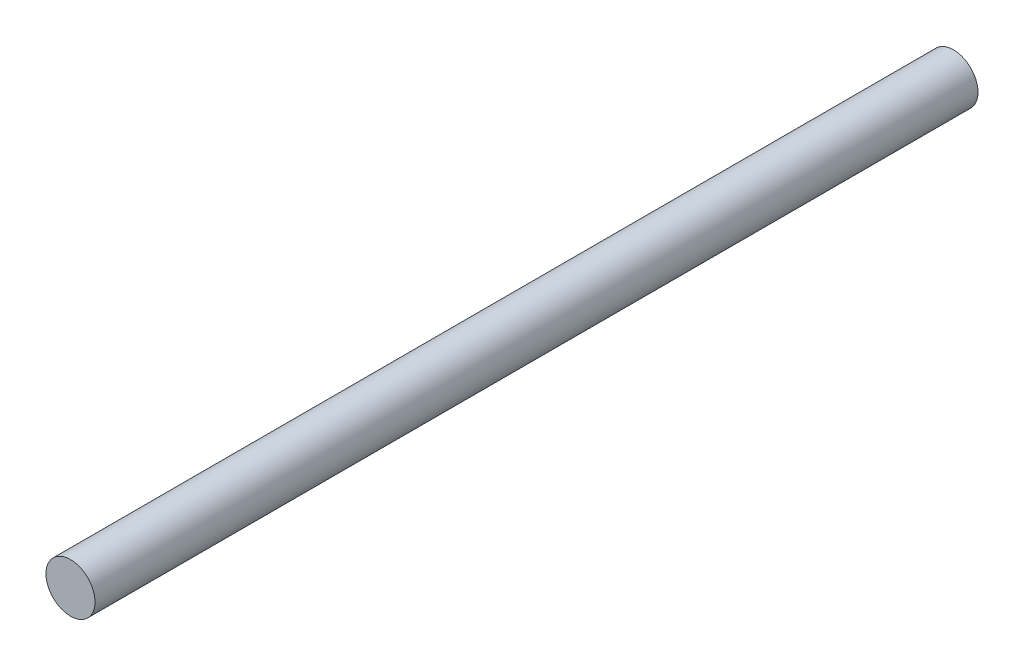
ISO-10303-21;
HEADER;
FILE_DESCRIPTION(('STEP AP214'),'2;1');
FILE_NAME('part.step','',(''),(''),'','','');
FILE_SCHEMA(('AUTOMOTIVE_DESIGN { 1 0 10303 214 1 1 1 1 }'));
ENDSEC;
DATA;
#1=APPLICATION_CONTEXT('core data for automotive mechanical design processes');
#2=APPLICATION_PROTOCOL_DEFINITION('international standard','automotive_design',2000,#1);
#3=PRODUCT_CONTEXT('',#1,'mechanical');
#4=PRODUCT('Part','Part','',(#3));
#5=PRODUCT_RELATED_PRODUCT_CATEGORY('part','',(#4));
#6=PRODUCT_DEFINITION_FORMATION('','',#4);
#7=PRODUCT_DEFINITION_CONTEXT('part definition',#1,'design');
#8=PRODUCT_DEFINITION('design','',#6,#7);
#9=PRODUCT_DEFINITION_SHAPE('','',#8);
#10=(LENGTH_UNIT() NAMED_UNIT(*) SI_UNIT(.MILLI.,.METRE.));
#11=(NAMED_UNIT(*) PLANE_ANGLE_UNIT() SI_UNIT($,.RADIAN.));
#12=(NAMED_UNIT(*) SI_UNIT($,.STERADIAN.) SOLID_ANGLE_UNIT());
#13=UNCERTAINTY_MEASURE_WITH_UNIT(LENGTH_MEASURE(1.E-05),#10,'distance_accuracy_value','');
#14=(GEOMETRIC_REPRESENTATION_CONTEXT(3) GLOBAL_UNCERTAINTY_ASSIGNED_CONTEXT((#13)) GLOBAL_UNIT_ASSIGNED_CONTEXT((#10,
#11,#12)) REPRESENTATION_CONTEXT('',''));
#15=CARTESIAN_POINT('',(0.,0.,0.));
#16=DIRECTION('',(0.,0.,1.));
#17=DIRECTION('',(1.,0.,0.));
#18=AXIS2_PLACEMENT_3D('',#15,#16,#17);
#19=CARTESIAN_POINT('',(0.,0.,180.));
#20=DIRECTION('',(0.,0.,-1.));
#21=DIRECTION('',(-1.,0.,0.));
#22=AXIS2_PLACEMENT_3D('',#19,#20,#21);
#23=CYLINDRICAL_SURFACE('',#22,10.);
#24=CARTESIAN_POINT('',(0.,0.,180.));
#25=DIRECTION('',(0.,0.,1.));
#26=DIRECTION('',(1.,0.,0.));
#27=AXIS2_PLACEMENT_3D('',#24,#25,#26);
#28=CIRCLE('',#27,10.);
#29=CARTESIAN_POINT('',(10.,0.,180.));
#30=VERTEX_POINT('',#29);
#31=EDGE_CURVE('E10',#30,#30,#28,.T.);
#32=ORIENTED_EDGE('',*,*,#31,.F.);
#33=EDGE_LOOP('',(#32));
#34=FACE_BOUND('',#33,.T.);
#35=CARTESIAN_POINT('',(0.,0.,-180.));
#36=DIRECTION('',(0.,0.,1.));
#37=DIRECTION('',(1.,0.,0.));
#38=AXIS2_PLACEMENT_3D('',#35,#36,#37);
#39=CIRCLE('',#38,10.);
#40=CARTESIAN_POINT('',(10.,0.,-180.));
#41=VERTEX_POINT('',#40);
#42=EDGE_CURVE('E44',#41,#41,#39,.T.);
#43=ORIENTED_EDGE('',*,*,#42,.T.);
#44=EDGE_LOOP('',(#43));
#45=FACE_BOUND('',#44,.T.);
#46=ADVANCED_FACE('F41',(#34,#45),#23,.T.);
#47=CARTESIAN_POINT('',(0.,0.,180.));
#48=DIRECTION('',(0.,0.,1.));
#49=DIRECTION('',(1.,0.,0.));
#50=AXIS2_PLACEMENT_3D('',#47,#48,#49);
#51=PLANE('',#50);
#52=ORIENTED_EDGE('',*,*,#31,.T.);
#53=EDGE_LOOP('',(#52));
#54=FACE_BOUND('',#53,.T.);
#55=ADVANCED_FACE('F58',(#54),#51,.T.);
#56=CARTESIAN_POINT('',(0.,0.,-180.));
#57=DIRECTION('',(0.,0.,1.));
#58=DIRECTION('',(1.,0.,0.));
#59=AXIS2_PLACEMENT_3D('',#56,#57,#58);
#60=PLANE('',#59);
#61=ORIENTED_EDGE('',*,*,#42,.F.);
#62=EDGE_LOOP('',(#61));
#63=FACE_BOUND('',#62,.T.);
#64=ADVANCED_FACE('F56',(#63),#60,.F.);
#65=CLOSED_SHELL('',(#46,#55,#64));
#66=MANIFOLD_SOLID_BREP('B2',#65);
#67=ADVANCED_BREP_SHAPE_REPRESENTATION('',(#18,#66),#14);
#68=SHAPE_DEFINITION_REPRESENTATION(#9,#67);
ENDSEC;
END-ISO-10303-21;
